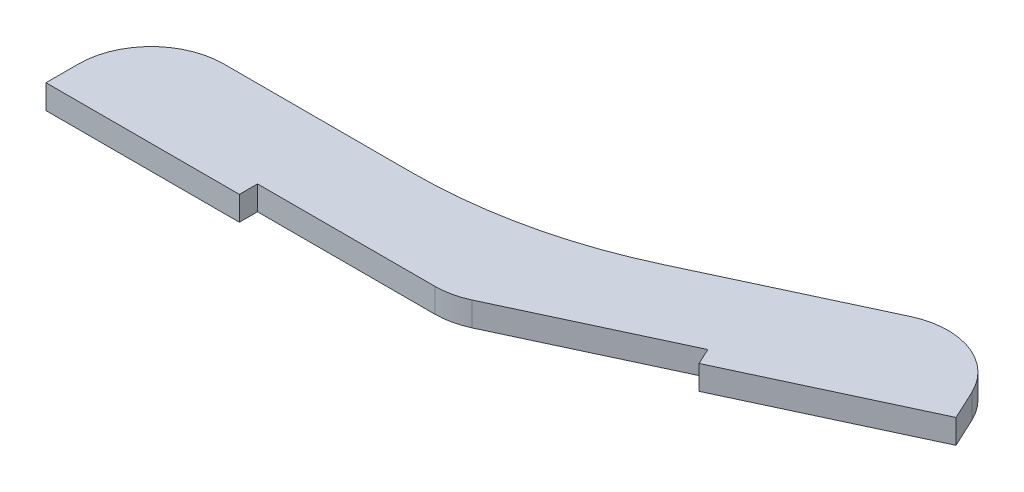
ISO-10303-21;
HEADER;
FILE_DESCRIPTION(('STEP AP214'),'2;1');
FILE_NAME('part.step','',(''),(''),'','','');
FILE_SCHEMA(('AUTOMOTIVE_DESIGN { 1 0 10303 214 1 1 1 1 }'));
ENDSEC;
DATA;
#1=APPLICATION_CONTEXT('core data for automotive mechanical design processes');
#2=APPLICATION_PROTOCOL_DEFINITION('international standard','automotive_design',2000,#1);
#3=PRODUCT_CONTEXT('',#1,'mechanical');
#4=PRODUCT('Part','Part','',(#3));
#5=PRODUCT_RELATED_PRODUCT_CATEGORY('part','',(#4));
#6=PRODUCT_DEFINITION_FORMATION('','',#4);
#7=PRODUCT_DEFINITION_CONTEXT('part definition',#1,'design');
#8=PRODUCT_DEFINITION('design','',#6,#7);
#9=PRODUCT_DEFINITION_SHAPE('','',#8);
#10=(LENGTH_UNIT() NAMED_UNIT(*) SI_UNIT(.MILLI.,.METRE.));
#11=(NAMED_UNIT(*) PLANE_ANGLE_UNIT() SI_UNIT($,.RADIAN.));
#12=(NAMED_UNIT(*) SI_UNIT($,.STERADIAN.) SOLID_ANGLE_UNIT());
#13=UNCERTAINTY_MEASURE_WITH_UNIT(LENGTH_MEASURE(1.E-05),#10,'distance_accuracy_value','');
#14=(GEOMETRIC_REPRESENTATION_CONTEXT(3) GLOBAL_UNCERTAINTY_ASSIGNED_CONTEXT((#13)) GLOBAL_UNIT_ASSIGNED_CONTEXT((#10,
#11,#12)) REPRESENTATION_CONTEXT('',''));
#15=CARTESIAN_POINT('',(0.,0.,0.));
#16=DIRECTION('',(0.,0.,1.));
#17=DIRECTION('',(1.,0.,0.));
#18=AXIS2_PLACEMENT_3D('',#15,#16,#17);
#19=CARTESIAN_POINT('',(-50.8,3.175,0.));
#20=DIRECTION('',(0.,0.,-1.));
#21=DIRECTION('',(-1.,0.,0.));
#22=AXIS2_PLACEMENT_3D('',#19,#20,#21);
#23=PLANE('',#22);
#24=DIRECTION('',(1.,0.,0.));
#25=VECTOR('',#24,1.);
#26=CARTESIAN_POINT('',(-50.8,0.,0.));
#27=LINE('',#26,#25);
#28=CARTESIAN_POINT('',(-25.4,0.,0.));
#29=VERTEX_POINT('',#28);
#30=CARTESIAN_POINT('',(-2.111641661674,0.,0.));
#31=VERTEX_POINT('',#30);
#32=EDGE_CURVE('E256',#29,#31,#27,.T.);
#33=ORIENTED_EDGE('',*,*,#32,.T.);
#34=DIRECTION('',(0.,-1.,0.));
#35=VECTOR('',#34,1.);
#36=CARTESIAN_POINT('',(-2.111641661674,3.175,0.));
#37=LINE('',#36,#35);
#38=CARTESIAN_POINT('',(-2.111641661674,3.175,0.));
#39=VERTEX_POINT('',#38);
#40=EDGE_CURVE('E213',#31,#39,#37,.F.);
#41=ORIENTED_EDGE('',*,*,#40,.T.);
#42=DIRECTION('',(1.,0.,0.));
#43=VECTOR('',#42,1.);
#44=CARTESIAN_POINT('',(-50.8,3.175,0.));
#45=LINE('',#44,#43);
#46=CARTESIAN_POINT('',(-25.4,3.175,0.));
#47=VERTEX_POINT('',#46);
#48=EDGE_CURVE('E190',#47,#39,#45,.T.);
#49=ORIENTED_EDGE('',*,*,#48,.F.);
#50=DIRECTION('',(0.,1.,0.));
#51=VECTOR('',#50,1.);
#52=CARTESIAN_POINT('',(-25.4,-27.267138330516,0.));
#53=LINE('',#52,#51);
#54=EDGE_CURVE('E184',#29,#47,#53,.T.);
#55=ORIENTED_EDGE('',*,*,#54,.F.);
#56=EDGE_LOOP('',(#33,#41,#49,#55));
#57=FACE_BOUND('',#56,.T.);
#58=ADVANCED_FACE('F33',(#57),#23,.F.);
#59=CARTESIAN_POINT('',(-50.8,3.175,0.));
#60=DIRECTION('',(1.,0.,0.));
#61=DIRECTION('',(0.,0.,-1.));
#62=AXIS2_PLACEMENT_3D('',#59,#60,#61);
#63=PLANE('',#62);
#64=DIRECTION('',(0.,0.,1.));
#65=VECTOR('',#64,1.);
#66=CARTESIAN_POINT('',(-50.8,3.175,0.));
#67=LINE('',#66,#65);
#68=CARTESIAN_POINT('',(-50.8,3.175,-1.905));
#69=VERTEX_POINT('',#68);
#70=CARTESIAN_POINT('',(-50.8,3.175,2.38125));
#71=VERTEX_POINT('',#70);
#72=EDGE_CURVE('E145',#69,#71,#67,.T.);
#73=ORIENTED_EDGE('',*,*,#72,.F.);
#74=DIRECTION('',(0.,1.,0.));
#75=VECTOR('',#74,1.);
#76=CARTESIAN_POINT('',(-50.8,3.175,-1.905));
#77=LINE('',#76,#75);
#78=CARTESIAN_POINT('',(-50.8,0.,-1.905));
#79=VERTEX_POINT('',#78);
#80=EDGE_CURVE('E223',#69,#79,#77,.F.);
#81=ORIENTED_EDGE('',*,*,#80,.T.);
#82=DIRECTION('',(0.,0.,1.));
#83=VECTOR('',#82,1.);
#84=CARTESIAN_POINT('',(-50.8,0.,0.));
#85=LINE('',#84,#83);
#86=CARTESIAN_POINT('',(-50.8,0.,2.38125));
#87=VERTEX_POINT('',#86);
#88=EDGE_CURVE('E254',#79,#87,#85,.T.);
#89=ORIENTED_EDGE('',*,*,#88,.T.);
#90=DIRECTION('',(0.,1.,0.));
#91=VECTOR('',#90,1.);
#92=CARTESIAN_POINT('',(-50.8,-27.267138330516,2.38125));
#93=LINE('',#92,#91);
#94=EDGE_CURVE('E188',#87,#71,#93,.T.);
#95=ORIENTED_EDGE('',*,*,#94,.T.);
#96=EDGE_LOOP('',(#73,#81,#89,#95));
#97=FACE_BOUND('',#96,.T.);
#98=ADVANCED_FACE('F292',(#97),#63,.F.);
#99=CARTESIAN_POINT('',(0.,3.175,0.));
#100=DIRECTION('',(-0.422618261740701,0.,-0.906307787036649));
#101=DIRECTION('',(-0.906307787036649,0.,0.422618261740701));
#102=AXIS2_PLACEMENT_3D('',#99,#100,#101);
#103=PLANE('',#102);
#104=DIRECTION('',(0.906307787036649,0.,-0.422618261740701));
#105=VECTOR('',#104,1.);
#106=CARTESIAN_POINT('',(0.,3.175,0.));
#107=LINE('',#106,#105);
#108=CARTESIAN_POINT('',(1.91379728140617,3.175,-0.892418328475917));
#109=VERTEX_POINT('',#108);
#110=CARTESIAN_POINT('',(23.0202177907309,3.175,-10.7345038482138));
#111=VERTEX_POINT('',#110);
#112=EDGE_CURVE('E250',#109,#111,#107,.T.);
#113=ORIENTED_EDGE('',*,*,#112,.F.);
#114=DIRECTION('',(0.,-1.,0.));
#115=VECTOR('',#114,1.);
#116=CARTESIAN_POINT('',(1.91379728140617,3.175,-0.892418328475917));
#117=LINE('',#116,#115);
#118=CARTESIAN_POINT('',(1.91379728140617,0.,-0.892418328475917));
#119=VERTEX_POINT('',#118);
#120=EDGE_CURVE('E217',#109,#119,#117,.T.);
#121=ORIENTED_EDGE('',*,*,#120,.T.);
#122=DIRECTION('',(0.906307787036649,0.,-0.422618261740701));
#123=VECTOR('',#122,1.);
#124=CARTESIAN_POINT('',(0.,0.,0.));
#125=LINE('',#124,#123);
#126=CARTESIAN_POINT('',(23.0202177907309,0.,-10.7345038482138));
#127=VERTEX_POINT('',#126);
#128=EDGE_CURVE('E146',#119,#127,#125,.T.);
#129=ORIENTED_EDGE('',*,*,#128,.T.);
#130=DIRECTION('',(0.,1.,0.));
#131=VECTOR('',#130,1.);
#132=CARTESIAN_POINT('',(23.0202177907309,-27.267138330516,-10.7345038482138));
#133=LINE('',#132,#131);
#134=EDGE_CURVE('E156',#127,#111,#133,.T.);
#135=ORIENTED_EDGE('',*,*,#134,.T.);
#136=EDGE_LOOP('',(#113,#121,#129,#135));
#137=FACE_BOUND('',#136,.T.);
#138=ADVANCED_FACE('F263',(#137),#103,.F.);
#139=CARTESIAN_POINT('',(40.6731836573549,3.175,-32.9791165917931));
#140=DIRECTION('',(-0.90630778703665,0.,0.422618261740699));
#141=DIRECTION('',(0.422618261740699,0.,0.90630778703665));
#142=AXIS2_PLACEMENT_3D('',#139,#140,#141);
#143=PLANE('',#142);
#144=DIRECTION('',(-0.422618261740699,0.,-0.90630778703665));
#145=VECTOR('',#144,1.);
#146=CARTESIAN_POINT('',(40.6731836573549,0.,-32.9791165917931));
#147=LINE('',#146,#145);
#148=CARTESIAN_POINT('',(47.0467953172318,0.,-19.3108622785466));
#149=VERTEX_POINT('',#148);
#150=CARTESIAN_POINT('',(45.2353477928458,0.,-23.1955240307324));
#151=VERTEX_POINT('',#150);
#152=EDGE_CURVE('E132',#149,#151,#147,.T.);
#153=ORIENTED_EDGE('',*,*,#152,.T.);
#154=DIRECTION('',(0.,1.,0.));
#155=VECTOR('',#154,1.);
#156=CARTESIAN_POINT('',(45.2353477928458,3.175,-23.1955240307324));
#157=LINE('',#156,#155);
#158=CARTESIAN_POINT('',(45.2353477928458,3.175,-23.1955240307324));
#159=VERTEX_POINT('',#158);
#160=EDGE_CURVE('E240',#151,#159,#157,.T.);
#161=ORIENTED_EDGE('',*,*,#160,.T.);
#162=DIRECTION('',(-0.422618261740699,0.,-0.90630778703665));
#163=VECTOR('',#162,1.);
#164=CARTESIAN_POINT('',(40.6731836573549,3.175,-32.9791165917931));
#165=LINE('',#164,#163);
#166=CARTESIAN_POINT('',(47.0467953172318,3.175,-19.3108622785466));
#167=VERTEX_POINT('',#166);
#168=EDGE_CURVE('E152',#167,#159,#165,.T.);
#169=ORIENTED_EDGE('',*,*,#168,.F.);
#170=DIRECTION('',(0.,1.,0.));
#171=VECTOR('',#170,1.);
#172=CARTESIAN_POINT('',(47.0467953172318,-27.267138330516,-19.3108622785466));
#173=LINE('',#172,#171);
#174=EDGE_CURVE('E149',#149,#167,#173,.T.);
#175=ORIENTED_EDGE('',*,*,#174,.F.);
#176=EDGE_LOOP('',(#153,#161,#169,#175));
#177=FACE_BOUND('',#176,.T.);
#178=ADVANCED_FACE('F150',(#177),#143,.F.);
#179=CARTESIAN_POINT('',(0.,3.175,0.));
#180=DIRECTION('',(0.,-1.,0.));
#181=DIRECTION('',(0.,0.,-1.));
#182=AXIS2_PLACEMENT_3D('',#179,#180,#181);
#183=PLANE('',#182);
#184=ORIENTED_EDGE('',*,*,#168,.T.);
#185=CARTESIAN_POINT('',(36.6027661213217,3.175,-19.1700850876522));
#186=DIRECTION('',(0.,-1.,0.));
#187=DIRECTION('',(0.,0.,-1.));
#188=AXIS2_PLACEMENT_3D('',#185,#186,#187);
#189=CIRCLE('',#188,9.525);
#190=CARTESIAN_POINT('',(32.5773271782415,3.175,-27.8026667591763));
#191=VERTEX_POINT('',#190);
#192=EDGE_CURVE('E238',#159,#191,#189,.F.);
#193=ORIENTED_EDGE('',*,*,#192,.T.);
#194=DIRECTION('',(0.90630778703665,0.,-0.422618261740699));
#195=VECTOR('',#194,1.);
#196=CARTESIAN_POINT('',(18.1896910590347,3.175,-21.0936018540427));
#197=LINE('',#196,#195);
#198=CARTESIAN_POINT('',(10.2246785486988,3.175,-17.3794555231727));
#199=VERTEX_POINT('',#198);
#200=EDGE_CURVE('E269',#199,#191,#197,.T.);
#201=ORIENTED_EDGE('',*,*,#200,.F.);
#202=CARTESIAN_POINT('',(-16.6115810718356,3.175,-74.93));
#203=DIRECTION('',(0.,-1.,0.));
#204=DIRECTION('',(0.,0.,-1.));
#205=AXIS2_PLACEMENT_3D('',#202,#203,#204);
#206=CIRCLE('',#205,63.5);
#207=CARTESIAN_POINT('',(-16.6115810718356,3.175,-11.43));
#208=VERTEX_POINT('',#207);
#209=EDGE_CURVE('E41',#199,#208,#206,.T.);
#210=ORIENTED_EDGE('',*,*,#209,.T.);
#211=DIRECTION('',(1.,0.,0.));
#212=VECTOR('',#211,1.);
#213=CARTESIAN_POINT('',(-25.4,3.175,-11.43));
#214=LINE('',#213,#212);
#215=CARTESIAN_POINT('',(-41.275,3.175,-11.43));
#216=VERTEX_POINT('',#215);
#217=EDGE_CURVE('E270',#216,#208,#214,.T.);
#218=ORIENTED_EDGE('',*,*,#217,.F.);
#219=CARTESIAN_POINT('',(-41.275,3.175,-1.905));
#220=DIRECTION('',(0.,-1.,0.));
#221=DIRECTION('',(0.,0.,-1.));
#222=AXIS2_PLACEMENT_3D('',#219,#220,#221);
#223=CIRCLE('',#222,9.525);
#224=EDGE_CURVE('E243',#216,#69,#223,.F.);
#225=ORIENTED_EDGE('',*,*,#224,.T.);
#226=ORIENTED_EDGE('',*,*,#72,.T.);
#227=DIRECTION('',(1.,0.,0.));
#228=VECTOR('',#227,1.);
#229=CARTESIAN_POINT('',(-50.8,3.175,2.38125));
#230=LINE('',#229,#228);
#231=CARTESIAN_POINT('',(-25.4,3.175,2.38125));
#232=VERTEX_POINT('',#231);
#233=EDGE_CURVE('E172',#71,#232,#230,.T.);
#234=ORIENTED_EDGE('',*,*,#233,.T.);
#235=DIRECTION('',(0.,0.,-1.));
#236=VECTOR('',#235,1.);
#237=CARTESIAN_POINT('',(-25.4,3.175,0.));
#238=LINE('',#237,#236);
#239=EDGE_CURVE('E175',#232,#47,#238,.T.);
#240=ORIENTED_EDGE('',*,*,#239,.T.);
#241=ORIENTED_EDGE('',*,*,#48,.T.);
#242=CARTESIAN_POINT('',(-2.11164166167401,3.175,-9.525));
#243=DIRECTION('',(0.,-1.,0.));
#244=DIRECTION('',(0.,0.,-1.));
#245=AXIS2_PLACEMENT_3D('',#242,#243,#244);
#246=CIRCLE('',#245,9.525);
#247=EDGE_CURVE('E245',#39,#109,#246,.F.);
#248=ORIENTED_EDGE('',*,*,#247,.T.);
#249=ORIENTED_EDGE('',*,*,#112,.T.);
#250=DIRECTION('',(0.4226182617407,0.,0.90630778703665));
#251=VECTOR('',#250,1.);
#252=CARTESIAN_POINT('',(24.0265775265009,3.175,-8.57635843033277));
#253=LINE('',#252,#251);
#254=CARTESIAN_POINT('',(24.0265775265009,3.175,-8.57635843033277));
#255=VERTEX_POINT('',#254);
#256=EDGE_CURVE('E163',#111,#255,#253,.T.);
#257=ORIENTED_EDGE('',*,*,#256,.T.);
#258=DIRECTION('',(0.906307787036649,0.,-0.422618261740701));
#259=VECTOR('',#258,1.);
#260=CARTESIAN_POINT('',(47.0467953172318,3.175,-19.3108622785466));
#261=LINE('',#260,#259);
#262=EDGE_CURVE('E161',#255,#167,#261,.T.);
#263=ORIENTED_EDGE('',*,*,#262,.T.);
#264=EDGE_LOOP('',(#184,#193,#201,#210,#218,#225,#226,#234,#240,#241,#248,#249,#257,#263));
#265=FACE_BOUND('',#264,.T.);
#266=ADVANCED_FACE('F247',(#265),#183,.F.);
#267=CARTESIAN_POINT('',(0.,0.,0.));
#268=DIRECTION('',(0.,-1.,0.));
#269=DIRECTION('',(0.,0.,-1.));
#270=AXIS2_PLACEMENT_3D('',#267,#268,#269);
#271=PLANE('',#270);
#272=DIRECTION('',(-0.90630778703665,0.,0.422618261740699));
#273=VECTOR('',#272,1.);
#274=CARTESIAN_POINT('',(-4.83052673169621,0.,-10.359098005829));
#275=LINE('',#274,#273);
#276=CARTESIAN_POINT('',(32.5773271782415,0.,-27.8026667591763));
#277=VERTEX_POINT('',#276);
#278=CARTESIAN_POINT('',(10.2246785486988,0.,-17.3794555231727));
#279=VERTEX_POINT('',#278);
#280=EDGE_CURVE('E209',#277,#279,#275,.T.);
#281=ORIENTED_EDGE('',*,*,#280,.F.);
#282=CARTESIAN_POINT('',(36.6027661213217,0.,-19.1700850876522));
#283=DIRECTION('',(0.,-1.,0.));
#284=DIRECTION('',(0.,0.,-1.));
#285=AXIS2_PLACEMENT_3D('',#282,#283,#284);
#286=CIRCLE('',#285,9.525);
#287=EDGE_CURVE('E141',#277,#151,#286,.T.);
#288=ORIENTED_EDGE('',*,*,#287,.T.);
#289=ORIENTED_EDGE('',*,*,#152,.F.);
#290=DIRECTION('',(0.906307787036649,0.,-0.422618261740701));
#291=VECTOR('',#290,1.);
#292=CARTESIAN_POINT('',(47.0467953172318,0.,-19.3108622785466));
#293=LINE('',#292,#291);
#294=CARTESIAN_POINT('',(24.0265775265009,0.,-8.57635843033277));
#295=VERTEX_POINT('',#294);
#296=EDGE_CURVE('E138',#295,#149,#293,.T.);
#297=ORIENTED_EDGE('',*,*,#296,.F.);
#298=DIRECTION('',(0.4226182617407,0.,0.90630778703665));
#299=VECTOR('',#298,1.);
#300=CARTESIAN_POINT('',(24.0265775265009,0.,-8.57635843033277));
#301=LINE('',#300,#299);
#302=EDGE_CURVE('E167',#127,#295,#301,.T.);
#303=ORIENTED_EDGE('',*,*,#302,.F.);
#304=ORIENTED_EDGE('',*,*,#128,.F.);
#305=CARTESIAN_POINT('',(-2.11164166167401,0.,-9.525));
#306=DIRECTION('',(0.,-1.,0.));
#307=DIRECTION('',(0.,0.,-1.));
#308=AXIS2_PLACEMENT_3D('',#305,#306,#307);
#309=CIRCLE('',#308,9.525);
#310=EDGE_CURVE('E234',#119,#31,#309,.T.);
#311=ORIENTED_EDGE('',*,*,#310,.T.);
#312=ORIENTED_EDGE('',*,*,#32,.F.);
#313=DIRECTION('',(0.,0.,-1.));
#314=VECTOR('',#313,1.);
#315=CARTESIAN_POINT('',(-25.4,0.,0.));
#316=LINE('',#315,#314);
#317=CARTESIAN_POINT('',(-25.4,0.,2.38125));
#318=VERTEX_POINT('',#317);
#319=EDGE_CURVE('E189',#318,#29,#316,.T.);
#320=ORIENTED_EDGE('',*,*,#319,.F.);
#321=DIRECTION('',(1.,0.,0.));
#322=VECTOR('',#321,1.);
#323=CARTESIAN_POINT('',(-50.8,0.,2.38125));
#324=LINE('',#323,#322);
#325=EDGE_CURVE('E176',#87,#318,#324,.T.);
#326=ORIENTED_EDGE('',*,*,#325,.F.);
#327=ORIENTED_EDGE('',*,*,#88,.F.);
#328=CARTESIAN_POINT('',(-41.275,0.,-1.905));
#329=DIRECTION('',(0.,-1.,0.));
#330=DIRECTION('',(0.,0.,-1.));
#331=AXIS2_PLACEMENT_3D('',#328,#329,#330);
#332=CIRCLE('',#331,9.525);
#333=CARTESIAN_POINT('',(-41.275,0.,-11.43));
#334=VERTEX_POINT('',#333);
#335=EDGE_CURVE('E231',#79,#334,#332,.T.);
#336=ORIENTED_EDGE('',*,*,#335,.T.);
#337=DIRECTION('',(-1.,0.,0.));
#338=VECTOR('',#337,1.);
#339=CARTESIAN_POINT('',(0.,0.,-11.43));
#340=LINE('',#339,#338);
#341=CARTESIAN_POINT('',(-16.6115810718356,0.,-11.43));
#342=VERTEX_POINT('',#341);
#343=EDGE_CURVE('E206',#342,#334,#340,.T.);
#344=ORIENTED_EDGE('',*,*,#343,.F.);
#345=CARTESIAN_POINT('',(-16.6115810718356,0.,-74.93));
#346=DIRECTION('',(0.,-1.,0.));
#347=DIRECTION('',(0.,0.,-1.));
#348=AXIS2_PLACEMENT_3D('',#345,#346,#347);
#349=CIRCLE('',#348,63.5);
#350=EDGE_CURVE('E11',#342,#279,#349,.F.);
#351=ORIENTED_EDGE('',*,*,#350,.T.);
#352=EDGE_LOOP('',(#281,#288,#289,#297,#303,#304,#311,#312,#320,#326,#327,#336,#344,#351));
#353=FACE_BOUND('',#352,.T.);
#354=ADVANCED_FACE('F135',(#353),#271,.T.);
#355=CARTESIAN_POINT('',(-50.8,-27.267138330516,2.38125));
#356=DIRECTION('',(0.,0.,1.));
#357=DIRECTION('',(1.,0.,0.));
#358=AXIS2_PLACEMENT_3D('',#355,#356,#357);
#359=PLANE('',#358);
#360=ORIENTED_EDGE('',*,*,#94,.F.);
#361=ORIENTED_EDGE('',*,*,#325,.T.);
#362=DIRECTION('',(0.,1.,0.));
#363=VECTOR('',#362,1.);
#364=CARTESIAN_POINT('',(-25.4,-27.267138330516,2.38125));
#365=LINE('',#364,#363);
#366=EDGE_CURVE('E179',#318,#232,#365,.T.);
#367=ORIENTED_EDGE('',*,*,#366,.T.);
#368=ORIENTED_EDGE('',*,*,#233,.F.);
#369=EDGE_LOOP('',(#360,#361,#367,#368));
#370=FACE_BOUND('',#369,.T.);
#371=ADVANCED_FACE('F305',(#370),#359,.T.);
#372=CARTESIAN_POINT('',(-25.4,-27.267138330516,0.));
#373=DIRECTION('',(1.,0.,0.));
#374=DIRECTION('',(0.,0.,-1.));
#375=AXIS2_PLACEMENT_3D('',#372,#373,#374);
#376=PLANE('',#375);
#377=ORIENTED_EDGE('',*,*,#366,.F.);
#378=ORIENTED_EDGE('',*,*,#319,.T.);
#379=ORIENTED_EDGE('',*,*,#54,.T.);
#380=ORIENTED_EDGE('',*,*,#239,.F.);
#381=EDGE_LOOP('',(#377,#378,#379,#380));
#382=FACE_BOUND('',#381,.T.);
#383=ADVANCED_FACE('F310',(#382),#376,.T.);
#384=CARTESIAN_POINT('',(47.0467953172318,-27.267138330516,-19.3108622785466));
#385=DIRECTION('',(0.422618261740701,0.,0.906307787036649));
#386=DIRECTION('',(0.906307787036649,0.,-0.422618261740701));
#387=AXIS2_PLACEMENT_3D('',#384,#385,#386);
#388=PLANE('',#387);
#389=DIRECTION('',(0.,1.,0.));
#390=VECTOR('',#389,1.);
#391=CARTESIAN_POINT('',(24.0265775265009,-27.267138330516,-8.57635843033277));
#392=LINE('',#391,#390);
#393=EDGE_CURVE('E160',#295,#255,#392,.T.);
#394=ORIENTED_EDGE('',*,*,#393,.F.);
#395=ORIENTED_EDGE('',*,*,#296,.T.);
#396=ORIENTED_EDGE('',*,*,#174,.T.);
#397=ORIENTED_EDGE('',*,*,#262,.F.);
#398=EDGE_LOOP('',(#394,#395,#396,#397));
#399=FACE_BOUND('',#398,.T.);
#400=ADVANCED_FACE('F159',(#399),#388,.T.);
#401=CARTESIAN_POINT('',(24.0265775265009,-27.267138330516,-8.57635843033277));
#402=DIRECTION('',(-0.90630778703665,0.,0.4226182617407));
#403=DIRECTION('',(0.4226182617407,0.,0.90630778703665));
#404=AXIS2_PLACEMENT_3D('',#401,#402,#403);
#405=PLANE('',#404);
#406=ORIENTED_EDGE('',*,*,#134,.F.);
#407=ORIENTED_EDGE('',*,*,#302,.T.);
#408=ORIENTED_EDGE('',*,*,#393,.T.);
#409=ORIENTED_EDGE('',*,*,#256,.F.);
#410=EDGE_LOOP('',(#406,#407,#408,#409));
#411=FACE_BOUND('',#410,.T.);
#412=ADVANCED_FACE('F268',(#411),#405,.T.);
#413=CARTESIAN_POINT('',(18.1896910590347,-5.00000000001367E-05,-21.0936018540427));
#414=DIRECTION('',(0.422618261740699,0.,0.90630778703665));
#415=DIRECTION('',(0.90630778703665,0.,-0.422618261740699));
#416=AXIS2_PLACEMENT_3D('',#413,#414,#415);
#417=PLANE('',#416);
#418=ORIENTED_EDGE('',*,*,#280,.T.);
#419=DIRECTION('',(0.,1.,0.));
#420=VECTOR('',#419,1.);
#421=CARTESIAN_POINT('',(10.2246785486988,3.175,-17.3794555231727));
#422=LINE('',#421,#420);
#423=EDGE_CURVE('E210',#279,#199,#422,.T.);
#424=ORIENTED_EDGE('',*,*,#423,.T.);
#425=ORIENTED_EDGE('',*,*,#200,.T.);
#426=DIRECTION('',(0.,1.,0.));
#427=VECTOR('',#426,1.);
#428=CARTESIAN_POINT('',(32.5773271782415,-5.00000000001367E-05,-27.8026667591763));
#429=LINE('',#428,#427);
#430=EDGE_CURVE('E236',#191,#277,#429,.F.);
#431=ORIENTED_EDGE('',*,*,#430,.T.);
#432=EDGE_LOOP('',(#418,#424,#425,#431));
#433=FACE_BOUND('',#432,.T.);
#434=ADVANCED_FACE('F277',(#433),#417,.F.);
#435=CARTESIAN_POINT('',(-25.4,-5.00000000001367E-05,-11.43));
#436=DIRECTION('',(0.,0.,1.));
#437=DIRECTION('',(1.,0.,0.));
#438=AXIS2_PLACEMENT_3D('',#435,#436,#437);
#439=PLANE('',#438);
#440=ORIENTED_EDGE('',*,*,#217,.T.);
#441=DIRECTION('',(0.,1.,0.));
#442=VECTOR('',#441,1.);
#443=CARTESIAN_POINT('',(-16.6115810718356,-2.50000000000684E-05,-11.43));
#444=LINE('',#443,#442);
#445=EDGE_CURVE('E54',#208,#342,#444,.F.);
#446=ORIENTED_EDGE('',*,*,#445,.T.);
#447=ORIENTED_EDGE('',*,*,#343,.T.);
#448=DIRECTION('',(0.,1.,0.));
#449=VECTOR('',#448,1.);
#450=CARTESIAN_POINT('',(-41.275,-5.00000000001367E-05,-11.43));
#451=LINE('',#450,#449);
#452=EDGE_CURVE('E227',#334,#216,#451,.T.);
#453=ORIENTED_EDGE('',*,*,#452,.T.);
#454=EDGE_LOOP('',(#440,#446,#447,#453));
#455=FACE_BOUND('',#454,.T.);
#456=ADVANCED_FACE('F273',(#455),#439,.F.);
#457=CARTESIAN_POINT('',(36.6027661213217,3.175,-19.1700850876522));
#458=DIRECTION('',(0.,1.,0.));
#459=DIRECTION('',(0.,0.,1.));
#460=AXIS2_PLACEMENT_3D('',#457,#458,#459);
#461=CYLINDRICAL_SURFACE('',#460,9.525);
#462=ORIENTED_EDGE('',*,*,#287,.F.);
#463=ORIENTED_EDGE('',*,*,#430,.F.);
#464=ORIENTED_EDGE('',*,*,#192,.F.);
#465=ORIENTED_EDGE('',*,*,#160,.F.);
#466=EDGE_LOOP('',(#462,#463,#464,#465));
#467=FACE_BOUND('',#466,.T.);
#468=ADVANCED_FACE('F278',(#467),#461,.T.);
#469=CARTESIAN_POINT('',(-41.275,-5.00000000001367E-05,-1.905));
#470=DIRECTION('',(0.,1.,0.));
#471=DIRECTION('',(0.,0.,1.));
#472=AXIS2_PLACEMENT_3D('',#469,#470,#471);
#473=CYLINDRICAL_SURFACE('',#472,9.525);
#474=ORIENTED_EDGE('',*,*,#335,.F.);
#475=ORIENTED_EDGE('',*,*,#80,.F.);
#476=ORIENTED_EDGE('',*,*,#224,.F.);
#477=ORIENTED_EDGE('',*,*,#452,.F.);
#478=EDGE_LOOP('',(#474,#475,#476,#477));
#479=FACE_BOUND('',#478,.T.);
#480=ADVANCED_FACE('F280',(#479),#473,.T.);
#481=CARTESIAN_POINT('',(-2.11164166167401,3.175,-9.525));
#482=DIRECTION('',(0.,-1.,0.));
#483=DIRECTION('',(0.,0.,-1.));
#484=AXIS2_PLACEMENT_3D('',#481,#482,#483);
#485=CYLINDRICAL_SURFACE('',#484,9.525);
#486=ORIENTED_EDGE('',*,*,#247,.F.);
#487=ORIENTED_EDGE('',*,*,#40,.F.);
#488=ORIENTED_EDGE('',*,*,#310,.F.);
#489=ORIENTED_EDGE('',*,*,#120,.F.);
#490=EDGE_LOOP('',(#486,#487,#488,#489));
#491=FACE_BOUND('',#490,.T.);
#492=ADVANCED_FACE('F286',(#491),#485,.T.);
#493=CARTESIAN_POINT('',(-16.6115810718356,-5.00000000001367E-05,-74.93));
#494=DIRECTION('',(0.,-1.,0.));
#495=DIRECTION('',(0.,0.,-1.));
#496=AXIS2_PLACEMENT_3D('',#493,#494,#495);
#497=CYLINDRICAL_SURFACE('',#496,63.5);
#498=ORIENTED_EDGE('',*,*,#350,.F.);
#499=ORIENTED_EDGE('',*,*,#445,.F.);
#500=ORIENTED_EDGE('',*,*,#209,.F.);
#501=ORIENTED_EDGE('',*,*,#423,.F.);
#502=EDGE_LOOP('',(#498,#499,#500,#501));
#503=FACE_BOUND('',#502,.T.);
#504=ADVANCED_FACE('F35',(#503),#497,.F.);
#505=CLOSED_SHELL('',(#58,#98,#138,#178,#266,#354,#371,#383,#400,#412,#434,#456,#468,#480,#492,#504));
#506=MANIFOLD_SOLID_BREP('B2',#505);
#507=ADVANCED_BREP_SHAPE_REPRESENTATION('',(#18,#506),#14);
#508=SHAPE_DEFINITION_REPRESENTATION(#9,#507);
ENDSEC;
END-ISO-10303-21;
